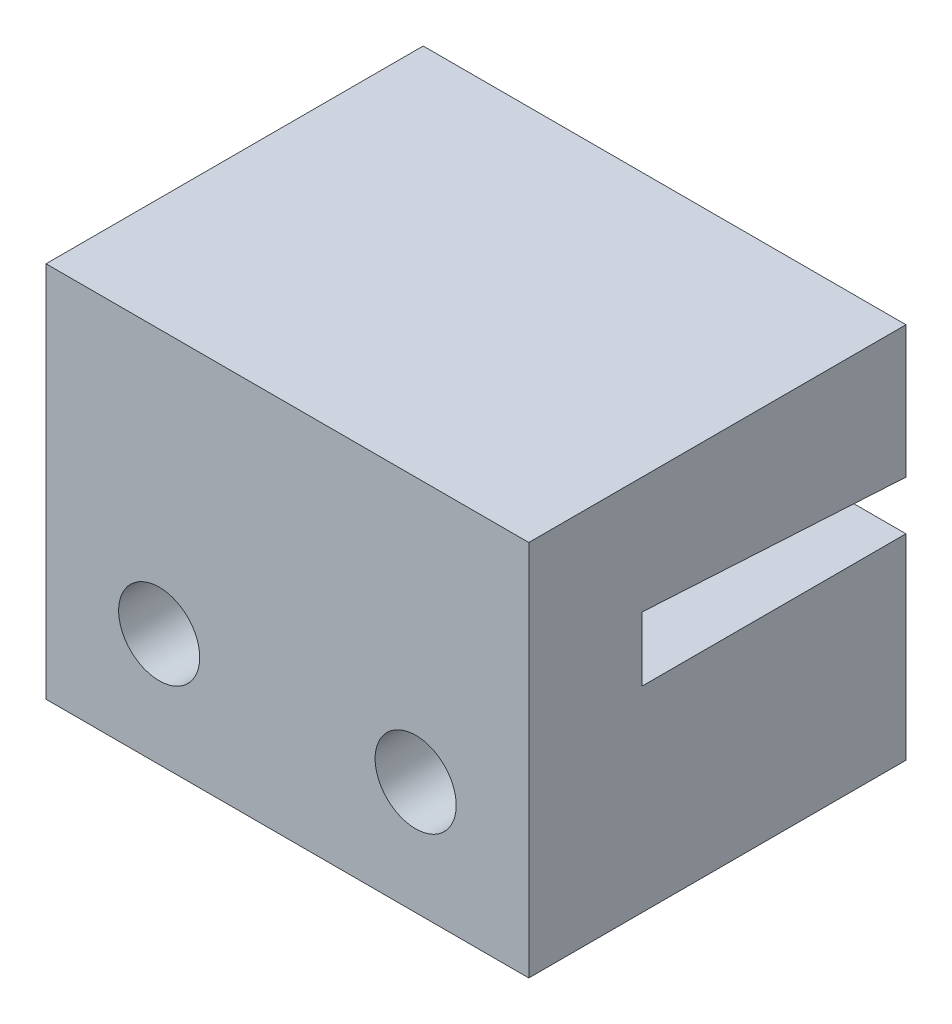
ISO-10303-21;
HEADER;
FILE_DESCRIPTION(('STEP AP214'),'2;1');
FILE_NAME('part.step','',(''),(''),'','','');
FILE_SCHEMA(('AUTOMOTIVE_DESIGN { 1 0 10303 214 1 1 1 1 }'));
ENDSEC;
DATA;
#1=APPLICATION_CONTEXT('core data for automotive mechanical design processes');
#2=APPLICATION_PROTOCOL_DEFINITION('international standard','automotive_design',2000,#1);
#3=PRODUCT_CONTEXT('',#1,'mechanical');
#4=PRODUCT('Part','Part','',(#3));
#5=PRODUCT_RELATED_PRODUCT_CATEGORY('part','',(#4));
#6=PRODUCT_DEFINITION_FORMATION('','',#4);
#7=PRODUCT_DEFINITION_CONTEXT('part definition',#1,'design');
#8=PRODUCT_DEFINITION('design','',#6,#7);
#9=PRODUCT_DEFINITION_SHAPE('','',#8);
#10=(LENGTH_UNIT() NAMED_UNIT(*) SI_UNIT(.MILLI.,.METRE.));
#11=(NAMED_UNIT(*) PLANE_ANGLE_UNIT() SI_UNIT($,.RADIAN.));
#12=(NAMED_UNIT(*) SI_UNIT($,.STERADIAN.) SOLID_ANGLE_UNIT());
#13=UNCERTAINTY_MEASURE_WITH_UNIT(LENGTH_MEASURE(1.E-05),#10,'distance_accuracy_value','');
#14=(GEOMETRIC_REPRESENTATION_CONTEXT(3) GLOBAL_UNCERTAINTY_ASSIGNED_CONTEXT((#13)) GLOBAL_UNIT_ASSIGNED_CONTEXT((#10,
#11,#12)) REPRESENTATION_CONTEXT('',''));
#15=CARTESIAN_POINT('',(0.,0.,0.));
#16=DIRECTION('',(0.,0.,1.));
#17=DIRECTION('',(1.,0.,0.));
#18=AXIS2_PLACEMENT_3D('',#15,#16,#17);
#19=CARTESIAN_POINT('',(0.,0.,0.));
#20=DIRECTION('',(0.,0.,1.));
#21=DIRECTION('',(1.,0.,0.));
#22=AXIS2_PLACEMENT_3D('',#19,#20,#21);
#23=PLANE('',#22);
#24=CARTESIAN_POINT('',(3.4,-1.,0.));
#25=DIRECTION('',(0.,0.,1.));
#26=DIRECTION('',(1.,0.,0.));
#27=AXIS2_PLACEMENT_3D('',#24,#25,#26);
#28=CIRCLE('',#27,1.075);
#29=CARTESIAN_POINT('',(4.475,-1.,0.));
#30=VERTEX_POINT('',#29);
#31=EDGE_CURVE('E132',#30,#30,#28,.T.);
#32=ORIENTED_EDGE('',*,*,#31,.T.);
#33=EDGE_LOOP('',(#32));
#34=FACE_BOUND('',#33,.T.);
#35=DIRECTION('',(1.,0.,0.));
#36=VECTOR('',#35,1.);
#37=CARTESIAN_POINT('',(0.,1.2,0.));
#38=LINE('',#37,#36);
#39=CARTESIAN_POINT('',(-6.4,1.2,0.));
#40=VERTEX_POINT('',#39);
#41=CARTESIAN_POINT('',(6.4,1.2,0.));
#42=VERTEX_POINT('',#41);
#43=EDGE_CURVE('E86',#40,#42,#38,.T.);
#44=ORIENTED_EDGE('',*,*,#43,.T.);
#45=DIRECTION('',(0.,1.,0.));
#46=VECTOR('',#45,1.);
#47=CARTESIAN_POINT('',(6.4,0.,0.));
#48=LINE('',#47,#46);
#49=CARTESIAN_POINT('',(6.4,-4.,0.));
#50=VERTEX_POINT('',#49);
#51=EDGE_CURVE('E96',#50,#42,#48,.T.);
#52=ORIENTED_EDGE('',*,*,#51,.F.);
#53=DIRECTION('',(1.,0.,0.));
#54=VECTOR('',#53,1.);
#55=CARTESIAN_POINT('',(0.,-4.,0.));
#56=LINE('',#55,#54);
#57=CARTESIAN_POINT('',(-6.4,-4.,0.));
#58=VERTEX_POINT('',#57);
#59=EDGE_CURVE('E108',#58,#50,#56,.T.);
#60=ORIENTED_EDGE('',*,*,#59,.F.);
#61=DIRECTION('',(0.,-1.,0.));
#62=VECTOR('',#61,1.);
#63=CARTESIAN_POINT('',(-6.4,0.,0.));
#64=LINE('',#63,#62);
#65=EDGE_CURVE('E63',#40,#58,#64,.T.);
#66=ORIENTED_EDGE('',*,*,#65,.F.);
#67=EDGE_LOOP('',(#44,#52,#60,#66));
#68=FACE_BOUND('',#67,.T.);
#69=CARTESIAN_POINT('',(-3.4,-0.999999999999999,0.));
#70=DIRECTION('',(0.,0.,1.));
#71=DIRECTION('',(1.,0.,0.));
#72=AXIS2_PLACEMENT_3D('',#69,#70,#71);
#73=CIRCLE('',#72,1.075);
#74=CARTESIAN_POINT('',(-2.325,-0.999999999999999,0.));
#75=VERTEX_POINT('',#74);
#76=EDGE_CURVE('E138',#75,#75,#73,.T.);
#77=ORIENTED_EDGE('',*,*,#76,.T.);
#78=EDGE_LOOP('',(#77));
#79=FACE_BOUND('',#78,.T.);
#80=ADVANCED_FACE('F35',(#34,#68,#79),#23,.F.);
#81=CARTESIAN_POINT('',(0.,0.,10.));
#82=DIRECTION('',(0.,0.,1.));
#83=DIRECTION('',(1.,0.,0.));
#84=AXIS2_PLACEMENT_3D('',#81,#82,#83);
#85=PLANE('',#84);
#86=CARTESIAN_POINT('',(3.4,-1.,10.));
#87=DIRECTION('',(0.,0.,1.));
#88=DIRECTION('',(1.,0.,0.));
#89=AXIS2_PLACEMENT_3D('',#86,#87,#88);
#90=CIRCLE('',#89,1.075);
#91=CARTESIAN_POINT('',(4.475,-1.,10.));
#92=VERTEX_POINT('',#91);
#93=EDGE_CURVE('E98',#92,#92,#90,.T.);
#94=ORIENTED_EDGE('',*,*,#93,.F.);
#95=EDGE_LOOP('',(#94));
#96=FACE_BOUND('',#95,.T.);
#97=DIRECTION('',(0.,-1.,0.));
#98=VECTOR('',#97,1.);
#99=CARTESIAN_POINT('',(-6.4,0.,10.));
#100=LINE('',#99,#98);
#101=CARTESIAN_POINT('',(-6.4,6.,10.));
#102=VERTEX_POINT('',#101);
#103=CARTESIAN_POINT('',(-6.4,-4.,10.));
#104=VERTEX_POINT('',#103);
#105=EDGE_CURVE('E103',#102,#104,#100,.T.);
#106=ORIENTED_EDGE('',*,*,#105,.T.);
#107=DIRECTION('',(1.,0.,0.));
#108=VECTOR('',#107,1.);
#109=CARTESIAN_POINT('',(0.,-4.,10.));
#110=LINE('',#109,#108);
#111=CARTESIAN_POINT('',(6.4,-4.,10.));
#112=VERTEX_POINT('',#111);
#113=EDGE_CURVE('E52',#104,#112,#110,.T.);
#114=ORIENTED_EDGE('',*,*,#113,.T.);
#115=DIRECTION('',(0.,1.,0.));
#116=VECTOR('',#115,1.);
#117=CARTESIAN_POINT('',(6.4,0.,10.));
#118=LINE('',#117,#116);
#119=CARTESIAN_POINT('',(6.4,6.,10.));
#120=VERTEX_POINT('',#119);
#121=EDGE_CURVE('E111',#112,#120,#118,.T.);
#122=ORIENTED_EDGE('',*,*,#121,.T.);
#123=DIRECTION('',(1.,0.,0.));
#124=VECTOR('',#123,1.);
#125=CARTESIAN_POINT('',(-6.4,6.,10.));
#126=LINE('',#125,#124);
#127=EDGE_CURVE('E157',#102,#120,#126,.T.);
#128=ORIENTED_EDGE('',*,*,#127,.F.);
#129=EDGE_LOOP('',(#106,#114,#122,#128));
#130=FACE_BOUND('',#129,.T.);
#131=CARTESIAN_POINT('',(-3.4,-0.999999999999999,10.));
#132=DIRECTION('',(0.,0.,1.));
#133=DIRECTION('',(1.,0.,0.));
#134=AXIS2_PLACEMENT_3D('',#131,#132,#133);
#135=CIRCLE('',#134,1.075);
#136=CARTESIAN_POINT('',(-2.325,-0.999999999999999,10.));
#137=VERTEX_POINT('',#136);
#138=EDGE_CURVE('E135',#137,#137,#135,.T.);
#139=ORIENTED_EDGE('',*,*,#138,.F.);
#140=EDGE_LOOP('',(#139));
#141=FACE_BOUND('',#140,.T.);
#142=ADVANCED_FACE('F202',(#96,#130,#141),#85,.T.);
#143=CARTESIAN_POINT('',(-6.4,0.,10.));
#144=DIRECTION('',(1.,0.,0.));
#145=DIRECTION('',(0.,0.,-1.));
#146=AXIS2_PLACEMENT_3D('',#143,#144,#145);
#147=PLANE('',#146);
#148=DIRECTION('',(0.,0.0574409581039475,0.998348905108881));
#149=VECTOR('',#148,1.);
#150=CARTESIAN_POINT('',(-6.4,3.06521251714506,9.8236400692423));
#151=LINE('',#150,#149);
#152=CARTESIAN_POINT('',(-6.4,2.5,0.));
#153=VERTEX_POINT('',#152);
#154=CARTESIAN_POINT('',(-6.4,2.90275168798205,7.));
#155=VERTEX_POINT('',#154);
#156=EDGE_CURVE('E141',#153,#155,#151,.T.);
#157=ORIENTED_EDGE('',*,*,#156,.T.);
#158=DIRECTION('',(0.,-1.,0.));
#159=VECTOR('',#158,1.);
#160=CARTESIAN_POINT('',(-6.4,0.,7.));
#161=LINE('',#160,#159);
#162=CARTESIAN_POINT('',(-6.4,1.2,7.));
#163=VERTEX_POINT('',#162);
#164=EDGE_CURVE('E127',#155,#163,#161,.T.);
#165=ORIENTED_EDGE('',*,*,#164,.T.);
#166=DIRECTION('',(0.,0.,-1.));
#167=VECTOR('',#166,1.);
#168=CARTESIAN_POINT('',(-6.4,1.2,7.));
#169=LINE('',#168,#167);
#170=EDGE_CURVE('E90',#163,#40,#169,.T.);
#171=ORIENTED_EDGE('',*,*,#170,.T.);
#172=ORIENTED_EDGE('',*,*,#65,.T.);
#173=DIRECTION('',(0.,0.,-1.));
#174=VECTOR('',#173,1.);
#175=CARTESIAN_POINT('',(-6.4,-4.,10.));
#176=LINE('',#175,#174);
#177=EDGE_CURVE('E11',#104,#58,#176,.T.);
#178=ORIENTED_EDGE('',*,*,#177,.F.);
#179=ORIENTED_EDGE('',*,*,#105,.F.);
#180=DIRECTION('',(0.,0.,1.));
#181=VECTOR('',#180,1.);
#182=CARTESIAN_POINT('',(-6.4,6.,0.));
#183=LINE('',#182,#181);
#184=CARTESIAN_POINT('',(-6.4,6.,0.));
#185=VERTEX_POINT('',#184);
#186=EDGE_CURVE('E159',#185,#102,#183,.T.);
#187=ORIENTED_EDGE('',*,*,#186,.F.);
#188=EDGE_CURVE('E117',#185,#153,#64,.T.);
#189=ORIENTED_EDGE('',*,*,#188,.T.);
#190=EDGE_LOOP('',(#157,#165,#171,#172,#178,#179,#187,#189));
#191=FACE_BOUND('',#190,.T.);
#192=ADVANCED_FACE('F37',(#191),#147,.F.);
#193=CARTESIAN_POINT('',(6.4,0.,10.));
#194=DIRECTION('',(-1.,0.,0.));
#195=DIRECTION('',(0.,0.,1.));
#196=AXIS2_PLACEMENT_3D('',#193,#194,#195);
#197=PLANE('',#196);
#198=DIRECTION('',(0.,1.,0.));
#199=VECTOR('',#198,1.);
#200=CARTESIAN_POINT('',(6.4,0.,7.));
#201=LINE('',#200,#199);
#202=CARTESIAN_POINT('',(6.4,1.2,7.));
#203=VERTEX_POINT('',#202);
#204=CARTESIAN_POINT('',(6.4,2.90275168798205,7.));
#205=VERTEX_POINT('',#204);
#206=EDGE_CURVE('E91',#203,#205,#201,.T.);
#207=ORIENTED_EDGE('',*,*,#206,.T.);
#208=DIRECTION('',(0.,0.0574409581039475,0.998348905108881));
#209=VECTOR('',#208,1.);
#210=CARTESIAN_POINT('',(6.4,2.5,0.));
#211=LINE('',#210,#209);
#212=CARTESIAN_POINT('',(6.4,2.5,0.));
#213=VERTEX_POINT('',#212);
#214=EDGE_CURVE('E148',#213,#205,#211,.T.);
#215=ORIENTED_EDGE('',*,*,#214,.F.);
#216=CARTESIAN_POINT('',(6.4,6.,0.));
#217=VERTEX_POINT('',#216);
#218=EDGE_CURVE('E104',#213,#217,#48,.T.);
#219=ORIENTED_EDGE('',*,*,#218,.T.);
#220=DIRECTION('',(0.,0.,-1.));
#221=VECTOR('',#220,1.);
#222=CARTESIAN_POINT('',(6.4,6.,0.));
#223=LINE('',#222,#221);
#224=EDGE_CURVE('E154',#120,#217,#223,.T.);
#225=ORIENTED_EDGE('',*,*,#224,.F.);
#226=ORIENTED_EDGE('',*,*,#121,.F.);
#227=DIRECTION('',(0.,0.,-1.));
#228=VECTOR('',#227,1.);
#229=CARTESIAN_POINT('',(6.4,-4.,10.));
#230=LINE('',#229,#228);
#231=EDGE_CURVE('E44',#112,#50,#230,.T.);
#232=ORIENTED_EDGE('',*,*,#231,.T.);
#233=ORIENTED_EDGE('',*,*,#51,.T.);
#234=DIRECTION('',(0.,0.,-1.));
#235=VECTOR('',#234,1.);
#236=CARTESIAN_POINT('',(6.4,1.2,7.));
#237=LINE('',#236,#235);
#238=EDGE_CURVE('E83',#203,#42,#237,.T.);
#239=ORIENTED_EDGE('',*,*,#238,.F.);
#240=EDGE_LOOP('',(#207,#215,#219,#225,#226,#232,#233,#239));
#241=FACE_BOUND('',#240,.T.);
#242=ADVANCED_FACE('F101',(#241),#197,.F.);
#243=CARTESIAN_POINT('',(0.,-4.,10.));
#244=DIRECTION('',(0.,1.,0.));
#245=DIRECTION('',(0.,0.,1.));
#246=AXIS2_PLACEMENT_3D('',#243,#244,#245);
#247=PLANE('',#246);
#248=ORIENTED_EDGE('',*,*,#59,.T.);
#249=ORIENTED_EDGE('',*,*,#231,.F.);
#250=ORIENTED_EDGE('',*,*,#113,.F.);
#251=ORIENTED_EDGE('',*,*,#177,.T.);
#252=EDGE_LOOP('',(#248,#249,#250,#251));
#253=FACE_BOUND('',#252,.T.);
#254=ADVANCED_FACE('F191',(#253),#247,.F.);
#255=ORIENTED_EDGE('',*,*,#218,.F.);
#256=DIRECTION('',(1.,0.,0.));
#257=VECTOR('',#256,1.);
#258=CARTESIAN_POINT('',(0.,2.5,0.));
#259=LINE('',#258,#257);
#260=EDGE_CURVE('E97',#153,#213,#259,.T.);
#261=ORIENTED_EDGE('',*,*,#260,.F.);
#262=ORIENTED_EDGE('',*,*,#188,.F.);
#263=DIRECTION('',(-1.,0.,0.));
#264=VECTOR('',#263,1.);
#265=CARTESIAN_POINT('',(-6.4,6.,0.));
#266=LINE('',#265,#264);
#267=EDGE_CURVE('E151',#217,#185,#266,.T.);
#268=ORIENTED_EDGE('',*,*,#267,.F.);
#269=EDGE_LOOP('',(#255,#261,#262,#268));
#270=FACE_BOUND('',#269,.T.);
#271=ADVANCED_FACE('F189',(#270),#23,.F.);
#272=CARTESIAN_POINT('',(0.,1.2,7.));
#273=DIRECTION('',(0.,1.,0.));
#274=DIRECTION('',(0.,0.,1.));
#275=AXIS2_PLACEMENT_3D('',#272,#273,#274);
#276=PLANE('',#275);
#277=ORIENTED_EDGE('',*,*,#43,.F.);
#278=ORIENTED_EDGE('',*,*,#170,.F.);
#279=DIRECTION('',(1.,0.,0.));
#280=VECTOR('',#279,1.);
#281=CARTESIAN_POINT('',(0.,1.2,7.));
#282=LINE('',#281,#280);
#283=EDGE_CURVE('E73',#163,#203,#282,.T.);
#284=ORIENTED_EDGE('',*,*,#283,.T.);
#285=ORIENTED_EDGE('',*,*,#238,.T.);
#286=EDGE_LOOP('',(#277,#278,#284,#285));
#287=FACE_BOUND('',#286,.T.);
#288=ADVANCED_FACE('F85',(#287),#276,.T.);
#289=CARTESIAN_POINT('',(0.,0.,7.));
#290=DIRECTION('',(0.,0.,1.));
#291=DIRECTION('',(1.,0.,0.));
#292=AXIS2_PLACEMENT_3D('',#289,#290,#291);
#293=PLANE('',#292);
#294=ORIENTED_EDGE('',*,*,#164,.F.);
#295=DIRECTION('',(1.,0.,0.));
#296=VECTOR('',#295,1.);
#297=CARTESIAN_POINT('',(-8.6,2.90275168798205,7.));
#298=LINE('',#297,#296);
#299=EDGE_CURVE('E145',#155,#205,#298,.T.);
#300=ORIENTED_EDGE('',*,*,#299,.T.);
#301=ORIENTED_EDGE('',*,*,#206,.F.);
#302=ORIENTED_EDGE('',*,*,#283,.F.);
#303=EDGE_LOOP('',(#294,#300,#301,#302));
#304=FACE_BOUND('',#303,.T.);
#305=ADVANCED_FACE('F184',(#304),#293,.F.);
#306=CARTESIAN_POINT('',(3.4,-1.,10.));
#307=DIRECTION('',(0.,0.,-1.));
#308=DIRECTION('',(-1.,0.,0.));
#309=AXIS2_PLACEMENT_3D('',#306,#307,#308);
#310=CYLINDRICAL_SURFACE('',#309,1.075);
#311=ORIENTED_EDGE('',*,*,#93,.T.);
#312=EDGE_LOOP('',(#311));
#313=FACE_BOUND('',#312,.T.);
#314=ORIENTED_EDGE('',*,*,#31,.F.);
#315=EDGE_LOOP('',(#314));
#316=FACE_BOUND('',#315,.T.);
#317=ADVANCED_FACE('F210',(#313,#316),#310,.F.);
#318=CARTESIAN_POINT('',(-3.4,-0.999999999999999,10.));
#319=DIRECTION('',(0.,0.,-1.));
#320=DIRECTION('',(-1.,0.,0.));
#321=AXIS2_PLACEMENT_3D('',#318,#319,#320);
#322=CYLINDRICAL_SURFACE('',#321,1.075);
#323=ORIENTED_EDGE('',*,*,#138,.T.);
#324=EDGE_LOOP('',(#323));
#325=FACE_BOUND('',#324,.T.);
#326=ORIENTED_EDGE('',*,*,#76,.F.);
#327=EDGE_LOOP('',(#326));
#328=FACE_BOUND('',#327,.T.);
#329=ADVANCED_FACE('F212',(#325,#328),#322,.F.);
#330=CARTESIAN_POINT('',(-8.6,2.5,0.));
#331=DIRECTION('',(0.,0.998348905108881,-0.0574409581039475));
#332=DIRECTION('',(0.,0.0574409581039475,0.998348905108881));
#333=AXIS2_PLACEMENT_3D('',#330,#331,#332);
#334=PLANE('',#333);
#335=ORIENTED_EDGE('',*,*,#260,.T.);
#336=ORIENTED_EDGE('',*,*,#214,.T.);
#337=ORIENTED_EDGE('',*,*,#299,.F.);
#338=ORIENTED_EDGE('',*,*,#156,.F.);
#339=EDGE_LOOP('',(#335,#336,#337,#338));
#340=FACE_BOUND('',#339,.T.);
#341=ADVANCED_FACE('F186',(#340),#334,.F.);
#342=CARTESIAN_POINT('',(0.,6.,0.));
#343=DIRECTION('',(0.,1.,0.));
#344=DIRECTION('',(0.,0.,1.));
#345=AXIS2_PLACEMENT_3D('',#342,#343,#344);
#346=PLANE('',#345);
#347=ORIENTED_EDGE('',*,*,#186,.T.);
#348=ORIENTED_EDGE('',*,*,#127,.T.);
#349=ORIENTED_EDGE('',*,*,#224,.T.);
#350=ORIENTED_EDGE('',*,*,#267,.T.);
#351=EDGE_LOOP('',(#347,#348,#349,#350));
#352=FACE_BOUND('',#351,.T.);
#353=ADVANCED_FACE('F163',(#352),#346,.T.);
#354=CLOSED_SHELL('',(#80,#142,#192,#242,#254,#271,#288,#305,#317,#329,#341,#353));
#355=MANIFOLD_SOLID_BREP('B2',#354);
#356=ADVANCED_BREP_SHAPE_REPRESENTATION('',(#18,#355),#14);
#357=SHAPE_DEFINITION_REPRESENTATION(#9,#356);
ENDSEC;
END-ISO-10303-21;
